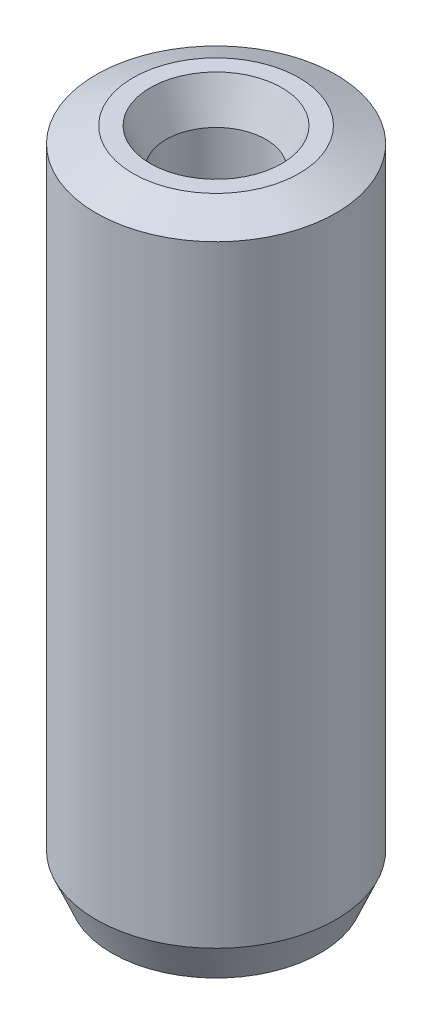
ISO-10303-21;
HEADER;
FILE_DESCRIPTION(('STEP AP214'),'2;1');
FILE_NAME('part.step','',(''),(''),'','','');
FILE_SCHEMA(('AUTOMOTIVE_DESIGN { 1 0 10303 214 1 1 1 1 }'));
ENDSEC;
DATA;
#1=APPLICATION_CONTEXT('core data for automotive mechanical design processes');
#2=APPLICATION_PROTOCOL_DEFINITION('international standard','automotive_design',2000,#1);
#3=PRODUCT_CONTEXT('',#1,'mechanical');
#4=PRODUCT('Part','Part','',(#3));
#5=PRODUCT_RELATED_PRODUCT_CATEGORY('part','',(#4));
#6=PRODUCT_DEFINITION_FORMATION('','',#4);
#7=PRODUCT_DEFINITION_CONTEXT('part definition',#1,'design');
#8=PRODUCT_DEFINITION('design','',#6,#7);
#9=PRODUCT_DEFINITION_SHAPE('','',#8);
#10=(LENGTH_UNIT() NAMED_UNIT(*) SI_UNIT(.MILLI.,.METRE.));
#11=(NAMED_UNIT(*) PLANE_ANGLE_UNIT() SI_UNIT($,.RADIAN.));
#12=(NAMED_UNIT(*) SI_UNIT($,.STERADIAN.) SOLID_ANGLE_UNIT());
#13=UNCERTAINTY_MEASURE_WITH_UNIT(LENGTH_MEASURE(1.E-05),#10,'distance_accuracy_value','');
#14=(GEOMETRIC_REPRESENTATION_CONTEXT(3) GLOBAL_UNCERTAINTY_ASSIGNED_CONTEXT((#13)) GLOBAL_UNIT_ASSIGNED_CONTEXT((#10,
#11,#12)) REPRESENTATION_CONTEXT('',''));
#15=CARTESIAN_POINT('',(0.,0.,0.));
#16=DIRECTION('',(0.,0.,1.));
#17=DIRECTION('',(1.,0.,0.));
#18=AXIS2_PLACEMENT_3D('',#15,#16,#17);
#19=CARTESIAN_POINT('',(0.,27.70646821855,0.));
#20=DIRECTION('',(0.,-1.,0.));
#21=DIRECTION('',(0.,0.,-1.));
#22=AXIS2_PLACEMENT_3D('',#19,#20,#21);
#23=CYLINDRICAL_SURFACE('',#22,5.);
#24=CARTESIAN_POINT('',(0.,1.53871539999451,0.));
#25=DIRECTION('',(0.,1.,0.));
#26=DIRECTION('',(0.,0.,1.));
#27=AXIS2_PLACEMENT_3D('',#24,#25,#26);
#28=CIRCLE('',#27,5.);
#29=CARTESIAN_POINT('',(0.,1.53871539999451,5.));
#30=VERTEX_POINT('',#29);
#31=EDGE_CURVE('E10',#30,#30,#28,.T.);
#32=ORIENTED_EDGE('',*,*,#31,.T.);
#33=EDGE_LOOP('',(#32));
#34=FACE_BOUND('',#33,.T.);
#35=CARTESIAN_POINT('',(0.,27.0483189980116,0.));
#36=DIRECTION('',(0.,1.,0.));
#37=DIRECTION('',(0.,0.,1.));
#38=AXIS2_PLACEMENT_3D('',#35,#36,#37);
#39=CIRCLE('',#38,5.);
#40=CARTESIAN_POINT('',(0.,27.0483189980116,5.));
#41=VERTEX_POINT('',#40);
#42=EDGE_CURVE('E50',#41,#41,#39,.F.);
#43=ORIENTED_EDGE('',*,*,#42,.T.);
#44=EDGE_LOOP('',(#43));
#45=FACE_BOUND('',#44,.T.);
#46=ADVANCED_FACE('F39',(#34,#45),#23,.T.);
#47=CARTESIAN_POINT('',(0.,27.70646821855,0.));
#48=DIRECTION('',(0.,1.,0.));
#49=DIRECTION('',(0.,0.,1.));
#50=AXIS2_PLACEMENT_3D('',#47,#48,#49);
#51=PLANE('',#50);
#52=CARTESIAN_POINT('',(0.,27.70646821855,0.));
#53=DIRECTION('',(0.,1.,0.));
#54=DIRECTION('',(0.,0.,1.));
#55=AXIS2_PLACEMENT_3D('',#52,#53,#54);
#56=CIRCLE('',#55,2.74170182620664);
#57=CARTESIAN_POINT('',(0.,27.70646821855,2.74170182620664));
#58=VERTEX_POINT('',#57);
#59=EDGE_CURVE('E58',#58,#58,#56,.F.);
#60=ORIENTED_EDGE('',*,*,#59,.T.);
#61=EDGE_LOOP('',(#60));
#62=FACE_BOUND('',#61,.T.);
#63=CARTESIAN_POINT('',(0.,27.70646821855,0.));
#64=DIRECTION('',(0.,1.,0.));
#65=DIRECTION('',(0.,0.,1.));
#66=AXIS2_PLACEMENT_3D('',#63,#64,#65);
#67=CIRCLE('',#66,3.46128460000547);
#68=CARTESIAN_POINT('',(0.,27.70646821855,3.46128460000547));
#69=VERTEX_POINT('',#68);
#70=EDGE_CURVE('E61',#69,#69,#67,.T.);
#71=ORIENTED_EDGE('',*,*,#70,.T.);
#72=EDGE_LOOP('',(#71));
#73=FACE_BOUND('',#72,.T.);
#74=ADVANCED_FACE('F88',(#62,#73),#51,.T.);
#75=CARTESIAN_POINT('',(0.,0.,0.));
#76=DIRECTION('',(0.,1.,0.));
#77=DIRECTION('',(0.,0.,1.));
#78=AXIS2_PLACEMENT_3D('',#75,#76,#77);
#79=PLANE('',#78);
#80=CARTESIAN_POINT('',(0.,0.,0.));
#81=DIRECTION('',(0.,1.,0.));
#82=DIRECTION('',(0.,0.,1.));
#83=AXIS2_PLACEMENT_3D('',#80,#81,#82);
#84=CIRCLE('',#83,3.62226800566278);
#85=CARTESIAN_POINT('',(0.,0.,3.62226800566278));
#86=VERTEX_POINT('',#85);
#87=EDGE_CURVE('E51',#86,#86,#84,.T.);
#88=ORIENTED_EDGE('',*,*,#87,.T.);
#89=EDGE_LOOP('',(#88));
#90=FACE_BOUND('',#89,.T.);
#91=CARTESIAN_POINT('',(0.,0.,0.));
#92=DIRECTION('',(0.,1.,0.));
#93=DIRECTION('',(0.,0.,1.));
#94=AXIS2_PLACEMENT_3D('',#91,#92,#93);
#95=CIRCLE('',#94,4.34185077946163);
#96=CARTESIAN_POINT('',(0.,0.,4.34185077946163));
#97=VERTEX_POINT('',#96);
#98=EDGE_CURVE('E54',#97,#97,#95,.F.);
#99=ORIENTED_EDGE('',*,*,#98,.T.);
#100=EDGE_LOOP('',(#99));
#101=FACE_BOUND('',#100,.T.);
#102=ADVANCED_FACE('F83',(#90,#101),#79,.F.);
#103=CARTESIAN_POINT('',(0.,27.70646821855,0.));
#104=DIRECTION('',(0.,-1.,0.));
#105=DIRECTION('',(0.,0.,-1.));
#106=AXIS2_PLACEMENT_3D('',#103,#104,#105);
#107=CYLINDRICAL_SURFACE('',#106,2.08355260566826);
#108=CARTESIAN_POINT('',(0.,26.1677528185554,0.));
#109=DIRECTION('',(0.,1.,0.));
#110=DIRECTION('',(0.,0.,1.));
#111=AXIS2_PLACEMENT_3D('',#108,#109,#110);
#112=CIRCLE('',#111,2.08355260566826);
#113=CARTESIAN_POINT('',(0.,26.1677528185554,2.08355260566826));
#114=VERTEX_POINT('',#113);
#115=EDGE_CURVE('E67',#114,#114,#112,.T.);
#116=ORIENTED_EDGE('',*,*,#115,.T.);
#117=EDGE_LOOP('',(#116));
#118=FACE_BOUND('',#117,.T.);
#119=CARTESIAN_POINT('',(0.,0.658149220538379,0.));
#120=DIRECTION('',(0.,1.,0.));
#121=DIRECTION('',(0.,0.,1.));
#122=AXIS2_PLACEMENT_3D('',#119,#120,#121);
#123=CIRCLE('',#122,2.08355260566826);
#124=CARTESIAN_POINT('',(0.,0.658149220538379,2.08355260566826));
#125=VERTEX_POINT('',#124);
#126=EDGE_CURVE('E69',#125,#125,#123,.F.);
#127=ORIENTED_EDGE('',*,*,#126,.T.);
#128=EDGE_LOOP('',(#127));
#129=FACE_BOUND('',#128,.T.);
#130=ADVANCED_FACE('F71',(#118,#129),#107,.F.);
#131=CARTESIAN_POINT('',(0.,26.1677528185554,0.));
#132=DIRECTION('',(0.,1.,0.));
#133=DIRECTION('',(0.,0.,1.));
#134=AXIS2_PLACEMENT_3D('',#131,#132,#133);
#135=CONICAL_SURFACE('',#134,2.08355260566826,0.404177676483736);
#136=ORIENTED_EDGE('',*,*,#59,.F.);
#137=EDGE_LOOP('',(#136));
#138=FACE_BOUND('',#137,.T.);
#139=ORIENTED_EDGE('',*,*,#115,.F.);
#140=EDGE_LOOP('',(#139));
#141=FACE_BOUND('',#140,.T.);
#142=ADVANCED_FACE('F77',(#138,#141),#135,.F.);
#143=CARTESIAN_POINT('',(0.,0.,0.));
#144=DIRECTION('',(0.,-1.,0.));
#145=DIRECTION('',(0.,0.,-1.));
#146=AXIS2_PLACEMENT_3D('',#143,#144,#145);
#147=CONICAL_SURFACE('',#146,3.62226800566278,1.16661865031116);
#148=ORIENTED_EDGE('',*,*,#126,.F.);
#149=EDGE_LOOP('',(#148));
#150=FACE_BOUND('',#149,.T.);
#151=ORIENTED_EDGE('',*,*,#87,.F.);
#152=EDGE_LOOP('',(#151));
#153=FACE_BOUND('',#152,.T.);
#154=ADVANCED_FACE('F73',(#150,#153),#147,.F.);
#155=CARTESIAN_POINT('',(0.,1.53871539999451,0.));
#156=DIRECTION('',(0.,1.,0.));
#157=DIRECTION('',(0.,0.,1.));
#158=AXIS2_PLACEMENT_3D('',#155,#156,#157);
#159=CONICAL_SURFACE('',#158,5.,0.404177676483734);
#160=ORIENTED_EDGE('',*,*,#98,.F.);
#161=EDGE_LOOP('',(#160));
#162=FACE_BOUND('',#161,.T.);
#163=ORIENTED_EDGE('',*,*,#31,.F.);
#164=EDGE_LOOP('',(#163));
#165=FACE_BOUND('',#164,.T.);
#166=ADVANCED_FACE('F76',(#162,#165),#159,.T.);
#167=CARTESIAN_POINT('',(0.,27.70646821855,0.));
#168=DIRECTION('',(0.,-1.,0.));
#169=DIRECTION('',(0.,0.,-1.));
#170=AXIS2_PLACEMENT_3D('',#167,#168,#169);
#171=CONICAL_SURFACE('',#170,3.46128460000547,1.16661865031116);
#172=ORIENTED_EDGE('',*,*,#42,.F.);
#173=EDGE_LOOP('',(#172));
#174=FACE_BOUND('',#173,.T.);
#175=ORIENTED_EDGE('',*,*,#70,.F.);
#176=EDGE_LOOP('',(#175));
#177=FACE_BOUND('',#176,.T.);
#178=ADVANCED_FACE('F45',(#174,#177),#171,.T.);
#179=CLOSED_SHELL('',(#46,#74,#102,#130,#142,#154,#166,#178));
#180=MANIFOLD_SOLID_BREP('B2',#179);
#181=ADVANCED_BREP_SHAPE_REPRESENTATION('',(#18,#180),#14);
#182=SHAPE_DEFINITION_REPRESENTATION(#9,#181);
ENDSEC;
END-ISO-10303-21;
